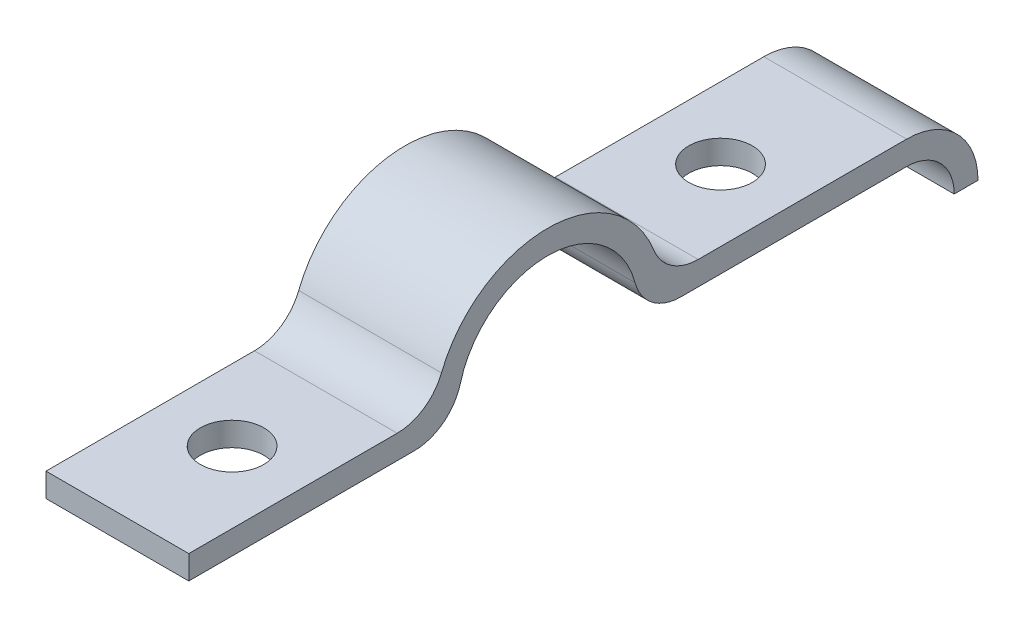
ISO-10303-21;
HEADER;
FILE_DESCRIPTION(('STEP AP214'),'2;1');
FILE_NAME('part.step','',(''),(''),'','','');
FILE_SCHEMA(('AUTOMOTIVE_DESIGN { 1 0 10303 214 1 1 1 1 }'));
ENDSEC;
DATA;
#1=APPLICATION_CONTEXT('core data for automotive mechanical design processes');
#2=APPLICATION_PROTOCOL_DEFINITION('international standard','automotive_design',2000,#1);
#3=PRODUCT_CONTEXT('',#1,'mechanical');
#4=PRODUCT('Part','Part','',(#3));
#5=PRODUCT_RELATED_PRODUCT_CATEGORY('part','',(#4));
#6=PRODUCT_DEFINITION_FORMATION('','',#4);
#7=PRODUCT_DEFINITION_CONTEXT('part definition',#1,'design');
#8=PRODUCT_DEFINITION('design','',#6,#7);
#9=PRODUCT_DEFINITION_SHAPE('','',#8);
#10=(LENGTH_UNIT() NAMED_UNIT(*) SI_UNIT(.MILLI.,.METRE.));
#11=(NAMED_UNIT(*) PLANE_ANGLE_UNIT() SI_UNIT($,.RADIAN.));
#12=(NAMED_UNIT(*) SI_UNIT($,.STERADIAN.) SOLID_ANGLE_UNIT());
#13=UNCERTAINTY_MEASURE_WITH_UNIT(LENGTH_MEASURE(1.E-05),#10,'distance_accuracy_value','');
#14=(GEOMETRIC_REPRESENTATION_CONTEXT(3) GLOBAL_UNCERTAINTY_ASSIGNED_CONTEXT((#13)) GLOBAL_UNIT_ASSIGNED_CONTEXT((#10,
#11,#12)) REPRESENTATION_CONTEXT('',''));
#15=CARTESIAN_POINT('',(0.,0.,0.));
#16=DIRECTION('',(0.,0.,1.));
#17=DIRECTION('',(1.,0.,0.));
#18=AXIS2_PLACEMENT_3D('',#15,#16,#17);
#19=CARTESIAN_POINT('',(3.81,0.635000000000002,8.03118117091129));
#20=DIRECTION('',(0.,-1.,0.));
#21=DIRECTION('',(0.,0.,-1.));
#22=AXIS2_PLACEMENT_3D('',#19,#20,#21);
#23=PLANE('',#22);
#24=CARTESIAN_POINT('',(0.,0.635000000000001,13.03528));
#25=DIRECTION('',(0.,1.,0.));
#26=DIRECTION('',(0.,0.,1.));
#27=AXIS2_PLACEMENT_3D('',#24,#25,#26);
#28=CIRCLE('',#27,1.69475489235775);
#29=CARTESIAN_POINT('',(0.,0.635,14.7300348923577));
#30=VERTEX_POINT('',#29);
#31=EDGE_CURVE('E288',#30,#30,#28,.T.);
#32=ORIENTED_EDGE('',*,*,#31,.F.);
#33=EDGE_LOOP('',(#32));
#34=FACE_BOUND('',#33,.T.);
#35=DIRECTION('',(0.,0.,1.));
#36=VECTOR('',#35,1.);
#37=CARTESIAN_POINT('',(-3.81,0.635000000000002,8.03118117091129));
#38=LINE('',#37,#36);
#39=CARTESIAN_POINT('',(-3.81,0.635000000000002,8.03118117091129));
#40=VERTEX_POINT('',#39);
#41=CARTESIAN_POINT('',(-3.81,0.634999999999999,19.15668));
#42=VERTEX_POINT('',#41);
#43=EDGE_CURVE('E166',#40,#42,#38,.T.);
#44=ORIENTED_EDGE('',*,*,#43,.T.);
#45=DIRECTION('',(-1.,0.,0.));
#46=VECTOR('',#45,1.);
#47=CARTESIAN_POINT('',(3.81,0.634999999999999,19.15668));
#48=LINE('',#47,#46);
#49=CARTESIAN_POINT('',(3.81,0.634999999999999,19.15668));
#50=VERTEX_POINT('',#49);
#51=EDGE_CURVE('E11',#50,#42,#48,.T.);
#52=ORIENTED_EDGE('',*,*,#51,.F.);
#53=DIRECTION('',(0.,0.,1.));
#54=VECTOR('',#53,1.);
#55=CARTESIAN_POINT('',(3.81,0.635000000000002,8.03118117091129));
#56=LINE('',#55,#54);
#57=CARTESIAN_POINT('',(3.81,0.635000000000002,8.03118117091129));
#58=VERTEX_POINT('',#57);
#59=EDGE_CURVE('E193',#58,#50,#56,.T.);
#60=ORIENTED_EDGE('',*,*,#59,.F.);
#61=DIRECTION('',(-1.,0.,0.));
#62=VECTOR('',#61,1.);
#63=CARTESIAN_POINT('',(3.81,0.635000000000002,8.03118117091129));
#64=LINE('',#63,#62);
#65=EDGE_CURVE('E162',#58,#40,#64,.T.);
#66=ORIENTED_EDGE('',*,*,#65,.T.);
#67=EDGE_LOOP('',(#44,#52,#60,#66));
#68=FACE_BOUND('',#67,.T.);
#69=ADVANCED_FACE('F34',(#34,#68),#23,.F.);
#70=CARTESIAN_POINT('',(3.81,-0.635000000000001,19.15668));
#71=DIRECTION('',(0.,0.,-1.));
#72=DIRECTION('',(-1.,0.,0.));
#73=AXIS2_PLACEMENT_3D('',#70,#71,#72);
#74=PLANE('',#73);
#75=DIRECTION('',(0.,-1.,0.));
#76=VECTOR('',#75,1.);
#77=CARTESIAN_POINT('',(-3.81,-0.635000000000001,19.15668));
#78=LINE('',#77,#76);
#79=CARTESIAN_POINT('',(-3.81,-0.635000000000001,19.15668));
#80=VERTEX_POINT('',#79);
#81=EDGE_CURVE('E169',#42,#80,#78,.T.);
#82=ORIENTED_EDGE('',*,*,#81,.T.);
#83=DIRECTION('',(-1.,0.,0.));
#84=VECTOR('',#83,1.);
#85=CARTESIAN_POINT('',(3.81,-0.635000000000001,19.15668));
#86=LINE('',#85,#84);
#87=CARTESIAN_POINT('',(3.81,-0.635000000000001,19.15668));
#88=VERTEX_POINT('',#87);
#89=EDGE_CURVE('E42',#88,#80,#86,.T.);
#90=ORIENTED_EDGE('',*,*,#89,.F.);
#91=DIRECTION('',(0.,-1.,0.));
#92=VECTOR('',#91,1.);
#93=CARTESIAN_POINT('',(3.81,-0.635000000000001,19.15668));
#94=LINE('',#93,#92);
#95=EDGE_CURVE('E111',#50,#88,#94,.T.);
#96=ORIENTED_EDGE('',*,*,#95,.F.);
#97=ORIENTED_EDGE('',*,*,#51,.T.);
#98=EDGE_LOOP('',(#82,#90,#96,#97));
#99=FACE_BOUND('',#98,.T.);
#100=ADVANCED_FACE('F281',(#99),#74,.F.);
#101=CARTESIAN_POINT('',(3.81,-0.634999999999999,7.11540097253837));
#102=DIRECTION('',(0.,1.,0.));
#103=DIRECTION('',(0.,0.,1.));
#104=AXIS2_PLACEMENT_3D('',#101,#102,#103);
#105=PLANE('',#104);
#106=CARTESIAN_POINT('',(0.,-0.635000000000001,13.03528));
#107=DIRECTION('',(0.,1.,0.));
#108=DIRECTION('',(0.,0.,1.));
#109=AXIS2_PLACEMENT_3D('',#106,#107,#108);
#110=CIRCLE('',#109,1.69475489235775);
#111=CARTESIAN_POINT('',(0.,-0.635000000000001,14.7300348923577));
#112=VERTEX_POINT('',#111);
#113=EDGE_CURVE('E290',#112,#112,#110,.F.);
#114=ORIENTED_EDGE('',*,*,#113,.F.);
#115=EDGE_LOOP('',(#114));
#116=FACE_BOUND('',#115,.T.);
#117=DIRECTION('',(0.,0.,-1.));
#118=VECTOR('',#117,1.);
#119=CARTESIAN_POINT('',(-3.81,-0.634999999999999,7.11540097253837));
#120=LINE('',#119,#118);
#121=CARTESIAN_POINT('',(-3.81,-0.634999999999999,7.11540097253837));
#122=VERTEX_POINT('',#121);
#123=EDGE_CURVE('E172',#80,#122,#120,.T.);
#124=ORIENTED_EDGE('',*,*,#123,.T.);
#125=DIRECTION('',(-1.,0.,0.));
#126=VECTOR('',#125,1.);
#127=CARTESIAN_POINT('',(3.81,-0.634999999999999,7.11540097253837));
#128=LINE('',#127,#126);
#129=CARTESIAN_POINT('',(3.81,-0.634999999999999,7.11540097253837));
#130=VERTEX_POINT('',#129);
#131=EDGE_CURVE('E218',#130,#122,#128,.T.);
#132=ORIENTED_EDGE('',*,*,#131,.F.);
#133=DIRECTION('',(0.,0.,-1.));
#134=VECTOR('',#133,1.);
#135=CARTESIAN_POINT('',(3.81,-0.634999999999999,7.11540097253837));
#136=LINE('',#135,#134);
#137=EDGE_CURVE('E226',#88,#130,#136,.T.);
#138=ORIENTED_EDGE('',*,*,#137,.F.);
#139=ORIENTED_EDGE('',*,*,#89,.T.);
#140=EDGE_LOOP('',(#124,#132,#138,#139));
#141=FACE_BOUND('',#140,.T.);
#142=ADVANCED_FACE('F224',(#116,#141),#105,.F.);
#143=CARTESIAN_POINT('',(3.81,1.905,7.11540097253837));
#144=DIRECTION('',(-1.,0.,0.));
#145=DIRECTION('',(0.,0.,1.));
#146=AXIS2_PLACEMENT_3D('',#143,#144,#145);
#147=CYLINDRICAL_SURFACE('',#146,2.54);
#148=CARTESIAN_POINT('',(-3.81,1.905,7.11540097253837));
#149=DIRECTION('',(1.,0.,0.));
#150=DIRECTION('',(0.,0.,1.));
#151=AXIS2_PLACEMENT_3D('',#148,#149,#150);
#152=CIRCLE('',#151,2.54);
#153=CARTESIAN_POINT('',(-3.81,1.24810344827586,4.66181443028376));
#154=VERTEX_POINT('',#153);
#155=EDGE_CURVE('E174',#122,#154,#152,.T.);
#156=ORIENTED_EDGE('',*,*,#155,.T.);
#157=DIRECTION('',(-1.,0.,0.));
#158=VECTOR('',#157,1.);
#159=CARTESIAN_POINT('',(3.81,1.24810344827586,4.66181443028376));
#160=LINE('',#159,#158);
#161=CARTESIAN_POINT('',(3.81,1.24810344827586,4.66181443028376));
#162=VERTEX_POINT('',#161);
#163=EDGE_CURVE('E215',#162,#154,#160,.T.);
#164=ORIENTED_EDGE('',*,*,#163,.F.);
#165=CARTESIAN_POINT('',(3.81,1.905,7.11540097253837));
#166=DIRECTION('',(1.,0.,0.));
#167=DIRECTION('',(0.,0.,1.));
#168=AXIS2_PLACEMENT_3D('',#165,#166,#167);
#169=CIRCLE('',#168,2.54);
#170=EDGE_CURVE('E244',#130,#162,#169,.T.);
#171=ORIENTED_EDGE('',*,*,#170,.F.);
#172=ORIENTED_EDGE('',*,*,#131,.T.);
#173=EDGE_LOOP('',(#156,#164,#171,#172));
#174=FACE_BOUND('',#173,.T.);
#175=ADVANCED_FACE('F235',(#174),#147,.T.);
#176=CARTESIAN_POINT('',(3.81,0.,0.));
#177=DIRECTION('',(-1.,0.,0.));
#178=DIRECTION('',(0.,0.,1.));
#179=AXIS2_PLACEMENT_3D('',#176,#177,#178);
#180=CYLINDRICAL_SURFACE('',#179,4.826);
#181=CARTESIAN_POINT('',(-3.81,0.,0.));
#182=DIRECTION('',(-1.,0.,0.));
#183=DIRECTION('',(0.,0.,-1.));
#184=AXIS2_PLACEMENT_3D('',#181,#182,#183);
#185=CIRCLE('',#184,4.826);
#186=CARTESIAN_POINT('',(-3.81,1.24810344827586,-4.66181443028376));
#187=VERTEX_POINT('',#186);
#188=EDGE_CURVE('E176',#154,#187,#185,.T.);
#189=ORIENTED_EDGE('',*,*,#188,.T.);
#190=DIRECTION('',(-1.,0.,0.));
#191=VECTOR('',#190,1.);
#192=CARTESIAN_POINT('',(3.81,1.24810344827586,-4.66181443028376));
#193=LINE('',#192,#191);
#194=CARTESIAN_POINT('',(3.81,1.24810344827586,-4.66181443028376));
#195=VERTEX_POINT('',#194);
#196=EDGE_CURVE('E212',#195,#187,#193,.T.);
#197=ORIENTED_EDGE('',*,*,#196,.F.);
#198=CARTESIAN_POINT('',(3.81,0.,0.));
#199=DIRECTION('',(-1.,0.,0.));
#200=DIRECTION('',(0.,0.,-1.));
#201=AXIS2_PLACEMENT_3D('',#198,#199,#200);
#202=CIRCLE('',#201,4.826);
#203=EDGE_CURVE('E241',#162,#195,#202,.T.);
#204=ORIENTED_EDGE('',*,*,#203,.F.);
#205=ORIENTED_EDGE('',*,*,#163,.T.);
#206=EDGE_LOOP('',(#189,#197,#204,#205));
#207=FACE_BOUND('',#206,.T.);
#208=ADVANCED_FACE('F239',(#207),#180,.F.);
#209=CARTESIAN_POINT('',(3.81,1.905,-7.11540097253837));
#210=DIRECTION('',(-1.,0.,0.));
#211=DIRECTION('',(0.,0.,1.));
#212=AXIS2_PLACEMENT_3D('',#209,#210,#211);
#213=CYLINDRICAL_SURFACE('',#212,2.54);
#214=CARTESIAN_POINT('',(-3.81,1.905,-7.11540097253837));
#215=DIRECTION('',(1.,0.,0.));
#216=DIRECTION('',(0.,0.,-1.));
#217=AXIS2_PLACEMENT_3D('',#214,#215,#216);
#218=CIRCLE('',#217,2.54);
#219=CARTESIAN_POINT('',(-3.81,-0.634999999999998,-7.11540097253837));
#220=VERTEX_POINT('',#219);
#221=EDGE_CURVE('E178',#187,#220,#218,.T.);
#222=ORIENTED_EDGE('',*,*,#221,.T.);
#223=DIRECTION('',(-1.,0.,0.));
#224=VECTOR('',#223,1.);
#225=CARTESIAN_POINT('',(3.81,-0.634999999999998,-7.11540097253837));
#226=LINE('',#225,#224);
#227=CARTESIAN_POINT('',(3.81,-0.634999999999998,-7.11540097253837));
#228=VERTEX_POINT('',#227);
#229=EDGE_CURVE('E209',#228,#220,#226,.T.);
#230=ORIENTED_EDGE('',*,*,#229,.F.);
#231=CARTESIAN_POINT('',(3.81,1.905,-7.11540097253837));
#232=DIRECTION('',(1.,0.,0.));
#233=DIRECTION('',(0.,0.,-1.));
#234=AXIS2_PLACEMENT_3D('',#231,#232,#233);
#235=CIRCLE('',#234,2.54);
#236=EDGE_CURVE('E243',#195,#228,#235,.T.);
#237=ORIENTED_EDGE('',*,*,#236,.F.);
#238=ORIENTED_EDGE('',*,*,#196,.T.);
#239=EDGE_LOOP('',(#222,#230,#237,#238));
#240=FACE_BOUND('',#239,.T.);
#241=ADVANCED_FACE('F326',(#240),#213,.T.);
#242=CARTESIAN_POINT('',(3.81,-0.634999999999996,-19.1566799999999));
#243=DIRECTION('',(0.,1.,0.));
#244=DIRECTION('',(0.,0.,1.));
#245=AXIS2_PLACEMENT_3D('',#242,#243,#244);
#246=PLANE('',#245);
#247=CARTESIAN_POINT('',(0.,-0.634999999999998,-13.03528));
#248=DIRECTION('',(0.,1.,0.));
#249=DIRECTION('',(0.,0.,1.));
#250=AXIS2_PLACEMENT_3D('',#247,#248,#249);
#251=CIRCLE('',#250,1.69475489235775);
#252=CARTESIAN_POINT('',(0.,-0.634999999999998,-11.3405251076423));
#253=VERTEX_POINT('',#252);
#254=EDGE_CURVE('E170',#253,#253,#251,.F.);
#255=ORIENTED_EDGE('',*,*,#254,.F.);
#256=EDGE_LOOP('',(#255));
#257=FACE_BOUND('',#256,.T.);
#258=DIRECTION('',(0.,0.,-1.));
#259=VECTOR('',#258,1.);
#260=CARTESIAN_POINT('',(-3.81,-0.634999999999996,-19.1566799999999));
#261=LINE('',#260,#259);
#262=CARTESIAN_POINT('',(-3.81,-0.634999999999996,-19.1566799999999));
#263=VERTEX_POINT('',#262);
#264=EDGE_CURVE('E180',#220,#263,#261,.T.);
#265=ORIENTED_EDGE('',*,*,#264,.T.);
#266=DIRECTION('',(-1.,0.,0.));
#267=VECTOR('',#266,1.);
#268=CARTESIAN_POINT('',(3.81,-0.634999999999996,-19.1566799999999));
#269=LINE('',#268,#267);
#270=CARTESIAN_POINT('',(3.81,-0.634999999999996,-19.1566799999999));
#271=VERTEX_POINT('',#270);
#272=EDGE_CURVE('E206',#271,#263,#269,.T.);
#273=ORIENTED_EDGE('',*,*,#272,.F.);
#274=DIRECTION('',(0.,0.,-1.));
#275=VECTOR('',#274,1.);
#276=CARTESIAN_POINT('',(3.81,-0.634999999999996,-19.1566799999999));
#277=LINE('',#276,#275);
#278=EDGE_CURVE('E246',#228,#271,#277,.T.);
#279=ORIENTED_EDGE('',*,*,#278,.F.);
#280=ORIENTED_EDGE('',*,*,#229,.T.);
#281=EDGE_LOOP('',(#265,#273,#279,#280));
#282=FACE_BOUND('',#281,.T.);
#283=ADVANCED_FACE('F322',(#257,#282),#246,.F.);
#284=CARTESIAN_POINT('',(3.81,-3.175,-19.1566799999999));
#285=DIRECTION('',(-1.,0.,0.));
#286=DIRECTION('',(0.,0.,1.));
#287=AXIS2_PLACEMENT_3D('',#284,#285,#286);
#288=CYLINDRICAL_SURFACE('',#287,2.54);
#289=CARTESIAN_POINT('',(-3.81,-3.175,-19.1566799999999));
#290=DIRECTION('',(-1.,0.,0.));
#291=DIRECTION('',(0.,0.,-1.));
#292=AXIS2_PLACEMENT_3D('',#289,#290,#291);
#293=CIRCLE('',#292,2.54);
#294=CARTESIAN_POINT('',(-3.81,-3.175,-21.6966799999999));
#295=VERTEX_POINT('',#294);
#296=EDGE_CURVE('E182',#263,#295,#293,.T.);
#297=ORIENTED_EDGE('',*,*,#296,.T.);
#298=DIRECTION('',(-1.,0.,0.));
#299=VECTOR('',#298,1.);
#300=CARTESIAN_POINT('',(3.81,-3.175,-21.6966799999999));
#301=LINE('',#300,#299);
#302=CARTESIAN_POINT('',(3.81,-3.175,-21.6966799999999));
#303=VERTEX_POINT('',#302);
#304=EDGE_CURVE('E203',#303,#295,#301,.T.);
#305=ORIENTED_EDGE('',*,*,#304,.F.);
#306=CARTESIAN_POINT('',(3.81,-3.175,-19.1566799999999));
#307=DIRECTION('',(-1.,0.,0.));
#308=DIRECTION('',(0.,0.,-1.));
#309=AXIS2_PLACEMENT_3D('',#306,#307,#308);
#310=CIRCLE('',#309,2.54);
#311=EDGE_CURVE('E252',#271,#303,#310,.T.);
#312=ORIENTED_EDGE('',*,*,#311,.F.);
#313=ORIENTED_EDGE('',*,*,#272,.T.);
#314=EDGE_LOOP('',(#297,#305,#312,#313));
#315=FACE_BOUND('',#314,.T.);
#316=ADVANCED_FACE('F318',(#315),#288,.F.);
#317=CARTESIAN_POINT('',(3.81,-3.175,-21.6966799999999));
#318=DIRECTION('',(0.,1.,0.));
#319=DIRECTION('',(0.,0.,1.));
#320=AXIS2_PLACEMENT_3D('',#317,#318,#319);
#321=PLANE('',#320);
#322=DIRECTION('',(0.,0.,-1.));
#323=VECTOR('',#322,1.);
#324=CARTESIAN_POINT('',(-3.81,-3.175,-21.6966799999999));
#325=LINE('',#324,#323);
#326=CARTESIAN_POINT('',(-3.81,-3.175,-22.9666799999999));
#327=VERTEX_POINT('',#326);
#328=EDGE_CURVE('E184',#295,#327,#325,.T.);
#329=ORIENTED_EDGE('',*,*,#328,.T.);
#330=DIRECTION('',(-1.,0.,0.));
#331=VECTOR('',#330,1.);
#332=CARTESIAN_POINT('',(3.81,-3.175,-22.9666799999999));
#333=LINE('',#332,#331);
#334=CARTESIAN_POINT('',(3.81,-3.175,-22.9666799999999));
#335=VERTEX_POINT('',#334);
#336=EDGE_CURVE('E200',#335,#327,#333,.T.);
#337=ORIENTED_EDGE('',*,*,#336,.F.);
#338=DIRECTION('',(0.,0.,-1.));
#339=VECTOR('',#338,1.);
#340=CARTESIAN_POINT('',(3.81,-3.175,-21.6966799999999));
#341=LINE('',#340,#339);
#342=EDGE_CURVE('E254',#303,#335,#341,.T.);
#343=ORIENTED_EDGE('',*,*,#342,.F.);
#344=ORIENTED_EDGE('',*,*,#304,.T.);
#345=EDGE_LOOP('',(#329,#337,#343,#344));
#346=FACE_BOUND('',#345,.T.);
#347=ADVANCED_FACE('F313',(#346),#321,.F.);
#348=CARTESIAN_POINT('',(3.81,-3.175,-19.1566799999999));
#349=DIRECTION('',(-1.,0.,0.));
#350=DIRECTION('',(0.,0.,1.));
#351=AXIS2_PLACEMENT_3D('',#348,#349,#350);
#352=CYLINDRICAL_SURFACE('',#351,3.81);
#353=CARTESIAN_POINT('',(-3.81,-3.175,-19.1566799999999));
#354=DIRECTION('',(1.,0.,0.));
#355=DIRECTION('',(0.,0.,-1.));
#356=AXIS2_PLACEMENT_3D('',#353,#354,#355);
#357=CIRCLE('',#356,3.81);
#358=CARTESIAN_POINT('',(-3.81,0.635000000000009,-19.1566799999999));
#359=VERTEX_POINT('',#358);
#360=EDGE_CURVE('E186',#327,#359,#357,.T.);
#361=ORIENTED_EDGE('',*,*,#360,.T.);
#362=DIRECTION('',(-1.,0.,0.));
#363=VECTOR('',#362,1.);
#364=CARTESIAN_POINT('',(3.81,0.635000000000009,-19.1566799999999));
#365=LINE('',#364,#363);
#366=CARTESIAN_POINT('',(3.81,0.635000000000009,-19.1566799999999));
#367=VERTEX_POINT('',#366);
#368=EDGE_CURVE('E197',#367,#359,#365,.T.);
#369=ORIENTED_EDGE('',*,*,#368,.F.);
#370=CARTESIAN_POINT('',(3.81,-3.175,-19.1566799999999));
#371=DIRECTION('',(1.,0.,0.));
#372=DIRECTION('',(0.,0.,-1.));
#373=AXIS2_PLACEMENT_3D('',#370,#371,#372);
#374=CIRCLE('',#373,3.81);
#375=EDGE_CURVE('E256',#335,#367,#374,.T.);
#376=ORIENTED_EDGE('',*,*,#375,.F.);
#377=ORIENTED_EDGE('',*,*,#336,.T.);
#378=EDGE_LOOP('',(#361,#369,#376,#377));
#379=FACE_BOUND('',#378,.T.);
#380=ADVANCED_FACE('F262',(#379),#352,.T.);
#381=CARTESIAN_POINT('',(3.81,0.635000000000009,-19.1566799999999));
#382=DIRECTION('',(0.,-1.,0.));
#383=DIRECTION('',(0.,0.,-1.));
#384=AXIS2_PLACEMENT_3D('',#381,#382,#383);
#385=PLANE('',#384);
#386=CARTESIAN_POINT('',(0.,0.635000000000007,-13.03528));
#387=DIRECTION('',(0.,1.,0.));
#388=DIRECTION('',(0.,0.,1.));
#389=AXIS2_PLACEMENT_3D('',#386,#387,#388);
#390=CIRCLE('',#389,1.69475489235775);
#391=CARTESIAN_POINT('',(0.,0.635000000000007,-11.3405251076423));
#392=VERTEX_POINT('',#391);
#393=EDGE_CURVE('E293',#392,#392,#390,.T.);
#394=ORIENTED_EDGE('',*,*,#393,.F.);
#395=EDGE_LOOP('',(#394));
#396=FACE_BOUND('',#395,.T.);
#397=DIRECTION('',(0.,0.,1.));
#398=VECTOR('',#397,1.);
#399=CARTESIAN_POINT('',(-3.81,0.635000000000009,-19.1566799999999));
#400=LINE('',#399,#398);
#401=CARTESIAN_POINT('',(-3.81,0.635000000000006,-8.03118117091129));
#402=VERTEX_POINT('',#401);
#403=EDGE_CURVE('E188',#359,#402,#400,.T.);
#404=ORIENTED_EDGE('',*,*,#403,.T.);
#405=DIRECTION('',(-1.,0.,0.));
#406=VECTOR('',#405,1.);
#407=CARTESIAN_POINT('',(3.81,0.635000000000006,-8.03118117091129));
#408=LINE('',#407,#406);
#409=CARTESIAN_POINT('',(3.81,0.635000000000006,-8.03118117091129));
#410=VERTEX_POINT('',#409);
#411=EDGE_CURVE('E157',#410,#402,#408,.T.);
#412=ORIENTED_EDGE('',*,*,#411,.F.);
#413=DIRECTION('',(0.,0.,1.));
#414=VECTOR('',#413,1.);
#415=CARTESIAN_POINT('',(3.81,0.635000000000009,-19.1566799999999));
#416=LINE('',#415,#414);
#417=EDGE_CURVE('E148',#367,#410,#416,.T.);
#418=ORIENTED_EDGE('',*,*,#417,.F.);
#419=ORIENTED_EDGE('',*,*,#368,.T.);
#420=EDGE_LOOP('',(#404,#412,#418,#419));
#421=FACE_BOUND('',#420,.T.);
#422=ADVANCED_FACE('F266',(#396,#421),#385,.F.);
#423=CARTESIAN_POINT('',(3.81,3.17500000000001,-8.03118117091129));
#424=DIRECTION('',(-1.,0.,0.));
#425=DIRECTION('',(0.,0.,1.));
#426=AXIS2_PLACEMENT_3D('',#423,#424,#425);
#427=CYLINDRICAL_SURFACE('',#426,2.54);
#428=CARTESIAN_POINT('',(-3.81,3.17500000000001,-8.03118117091129));
#429=DIRECTION('',(-1.,0.,0.));
#430=DIRECTION('',(0.,0.,1.));
#431=AXIS2_PLACEMENT_3D('',#428,#429,#430);
#432=CIRCLE('',#431,2.54);
#433=CARTESIAN_POINT('',(-3.81,2.24117647058824,-5.66906906181973));
#434=VERTEX_POINT('',#433);
#435=EDGE_CURVE('E156',#402,#434,#432,.T.);
#436=ORIENTED_EDGE('',*,*,#435,.T.);
#437=DIRECTION('',(-1.,0.,0.));
#438=VECTOR('',#437,1.);
#439=CARTESIAN_POINT('',(3.81,2.24117647058824,-5.66906906181973));
#440=LINE('',#439,#438);
#441=CARTESIAN_POINT('',(3.81,2.24117647058824,-5.66906906181973));
#442=VERTEX_POINT('',#441);
#443=EDGE_CURVE('E153',#442,#434,#440,.T.);
#444=ORIENTED_EDGE('',*,*,#443,.F.);
#445=CARTESIAN_POINT('',(3.81,3.17500000000001,-8.03118117091129));
#446=DIRECTION('',(-1.,0.,0.));
#447=DIRECTION('',(0.,0.,1.));
#448=AXIS2_PLACEMENT_3D('',#445,#446,#447);
#449=CIRCLE('',#448,2.54);
#450=EDGE_CURVE('E142',#410,#442,#449,.T.);
#451=ORIENTED_EDGE('',*,*,#450,.F.);
#452=ORIENTED_EDGE('',*,*,#411,.T.);
#453=EDGE_LOOP('',(#436,#444,#451,#452));
#454=FACE_BOUND('',#453,.T.);
#455=ADVANCED_FACE('F154',(#454),#427,.F.);
#456=CARTESIAN_POINT('',(3.81,0.,0.));
#457=DIRECTION('',(-1.,0.,0.));
#458=DIRECTION('',(0.,0.,1.));
#459=AXIS2_PLACEMENT_3D('',#456,#457,#458);
#460=CYLINDRICAL_SURFACE('',#459,6.096);
#461=CARTESIAN_POINT('',(-3.81,0.,0.));
#462=DIRECTION('',(1.,0.,0.));
#463=DIRECTION('',(0.,0.,-1.));
#464=AXIS2_PLACEMENT_3D('',#461,#462,#463);
#465=CIRCLE('',#464,6.096);
#466=CARTESIAN_POINT('',(-3.81,2.24117647058824,5.66906906181973));
#467=VERTEX_POINT('',#466);
#468=EDGE_CURVE('E97',#434,#467,#465,.T.);
#469=ORIENTED_EDGE('',*,*,#468,.T.);
#470=DIRECTION('',(-1.,0.,0.));
#471=VECTOR('',#470,1.);
#472=CARTESIAN_POINT('',(3.81,2.24117647058824,5.66906906181973));
#473=LINE('',#472,#471);
#474=CARTESIAN_POINT('',(3.81,2.24117647058824,5.66906906181973));
#475=VERTEX_POINT('',#474);
#476=EDGE_CURVE('E158',#475,#467,#473,.T.);
#477=ORIENTED_EDGE('',*,*,#476,.F.);
#478=CARTESIAN_POINT('',(3.81,0.,0.));
#479=DIRECTION('',(1.,0.,0.));
#480=DIRECTION('',(0.,0.,-1.));
#481=AXIS2_PLACEMENT_3D('',#478,#479,#480);
#482=CIRCLE('',#481,6.096);
#483=EDGE_CURVE('E146',#442,#475,#482,.T.);
#484=ORIENTED_EDGE('',*,*,#483,.F.);
#485=ORIENTED_EDGE('',*,*,#443,.T.);
#486=EDGE_LOOP('',(#469,#477,#484,#485));
#487=FACE_BOUND('',#486,.T.);
#488=ADVANCED_FACE('F160',(#487),#460,.T.);
#489=CARTESIAN_POINT('',(3.81,3.175,8.03118117091129));
#490=DIRECTION('',(-1.,0.,0.));
#491=DIRECTION('',(0.,0.,1.));
#492=AXIS2_PLACEMENT_3D('',#489,#490,#491);
#493=CYLINDRICAL_SURFACE('',#492,2.54);
#494=CARTESIAN_POINT('',(-3.81,3.175,8.03118117091129));
#495=DIRECTION('',(-1.,0.,0.));
#496=DIRECTION('',(0.,0.,-1.));
#497=AXIS2_PLACEMENT_3D('',#494,#495,#496);
#498=CIRCLE('',#497,2.54);
#499=EDGE_CURVE('E103',#467,#40,#498,.T.);
#500=ORIENTED_EDGE('',*,*,#499,.T.);
#501=ORIENTED_EDGE('',*,*,#65,.F.);
#502=CARTESIAN_POINT('',(3.81,3.175,8.03118117091129));
#503=DIRECTION('',(-1.,0.,0.));
#504=DIRECTION('',(0.,0.,-1.));
#505=AXIS2_PLACEMENT_3D('',#502,#503,#504);
#506=CIRCLE('',#505,2.54);
#507=EDGE_CURVE('E50',#475,#58,#506,.T.);
#508=ORIENTED_EDGE('',*,*,#507,.F.);
#509=ORIENTED_EDGE('',*,*,#476,.T.);
#510=EDGE_LOOP('',(#500,#501,#508,#509));
#511=FACE_BOUND('',#510,.T.);
#512=ADVANCED_FACE('F270',(#511),#493,.F.);
#513=CARTESIAN_POINT('',(3.81,1.905,7.11540097253837));
#514=DIRECTION('',(-1.,0.,0.));
#515=DIRECTION('',(0.,0.,1.));
#516=AXIS2_PLACEMENT_3D('',#513,#514,#515);
#517=PLANE('',#516);
#518=ORIENTED_EDGE('',*,*,#59,.T.);
#519=ORIENTED_EDGE('',*,*,#95,.T.);
#520=ORIENTED_EDGE('',*,*,#137,.T.);
#521=ORIENTED_EDGE('',*,*,#170,.T.);
#522=ORIENTED_EDGE('',*,*,#203,.T.);
#523=ORIENTED_EDGE('',*,*,#236,.T.);
#524=ORIENTED_EDGE('',*,*,#278,.T.);
#525=ORIENTED_EDGE('',*,*,#311,.T.);
#526=ORIENTED_EDGE('',*,*,#342,.T.);
#527=ORIENTED_EDGE('',*,*,#375,.T.);
#528=ORIENTED_EDGE('',*,*,#417,.T.);
#529=ORIENTED_EDGE('',*,*,#450,.T.);
#530=ORIENTED_EDGE('',*,*,#483,.T.);
#531=ORIENTED_EDGE('',*,*,#507,.T.);
#532=EDGE_LOOP('',(#518,#519,#520,#521,#522,#523,#524,#525,#526,#527,#528,#529,#530,#531));
#533=FACE_BOUND('',#532,.T.);
#534=ADVANCED_FACE('F144',(#533),#517,.F.);
#535=CARTESIAN_POINT('',(-3.81,1.905,7.11540097253837));
#536=DIRECTION('',(-1.,0.,0.));
#537=DIRECTION('',(0.,0.,1.));
#538=AXIS2_PLACEMENT_3D('',#535,#536,#537);
#539=PLANE('',#538);
#540=ORIENTED_EDGE('',*,*,#43,.F.);
#541=ORIENTED_EDGE('',*,*,#499,.F.);
#542=ORIENTED_EDGE('',*,*,#468,.F.);
#543=ORIENTED_EDGE('',*,*,#435,.F.);
#544=ORIENTED_EDGE('',*,*,#403,.F.);
#545=ORIENTED_EDGE('',*,*,#360,.F.);
#546=ORIENTED_EDGE('',*,*,#328,.F.);
#547=ORIENTED_EDGE('',*,*,#296,.F.);
#548=ORIENTED_EDGE('',*,*,#264,.F.);
#549=ORIENTED_EDGE('',*,*,#221,.F.);
#550=ORIENTED_EDGE('',*,*,#188,.F.);
#551=ORIENTED_EDGE('',*,*,#155,.F.);
#552=ORIENTED_EDGE('',*,*,#123,.F.);
#553=ORIENTED_EDGE('',*,*,#81,.F.);
#554=EDGE_LOOP('',(#540,#541,#542,#543,#544,#545,#546,#547,#548,#549,#550,#551,#552,#553));
#555=FACE_BOUND('',#554,.T.);
#556=ADVANCED_FACE('F230',(#555),#539,.T.);
#557=CARTESIAN_POINT('',(0.,-3.176,-13.03528));
#558=DIRECTION('',(0.,1.,0.));
#559=DIRECTION('',(0.,0.,1.));
#560=AXIS2_PLACEMENT_3D('',#557,#558,#559);
#561=CYLINDRICAL_SURFACE('',#560,1.69475489235775);
#562=ORIENTED_EDGE('',*,*,#393,.T.);
#563=EDGE_LOOP('',(#562));
#564=FACE_BOUND('',#563,.T.);
#565=ORIENTED_EDGE('',*,*,#254,.T.);
#566=EDGE_LOOP('',(#565));
#567=FACE_BOUND('',#566,.T.);
#568=ADVANCED_FACE('F303',(#564,#567),#561,.F.);
#569=CARTESIAN_POINT('',(0.,-3.176,13.03528));
#570=DIRECTION('',(0.,1.,0.));
#571=DIRECTION('',(0.,0.,1.));
#572=AXIS2_PLACEMENT_3D('',#569,#570,#571);
#573=CYLINDRICAL_SURFACE('',#572,1.69475489235775);
#574=ORIENTED_EDGE('',*,*,#31,.T.);
#575=EDGE_LOOP('',(#574));
#576=FACE_BOUND('',#575,.T.);
#577=ORIENTED_EDGE('',*,*,#113,.T.);
#578=EDGE_LOOP('',(#577));
#579=FACE_BOUND('',#578,.T.);
#580=ADVANCED_FACE('F341',(#576,#579),#573,.F.);
#581=CLOSED_SHELL('',(#69,#100,#142,#175,#208,#241,#283,#316,#347,#380,#422,#455,#488,#512,#534,
#556,#568,#580));
#582=MANIFOLD_SOLID_BREP('B2',#581);
#583=ADVANCED_BREP_SHAPE_REPRESENTATION('',(#18,#582),#14);
#584=SHAPE_DEFINITION_REPRESENTATION(#9,#583);
ENDSEC;
END-ISO-10303-21;
